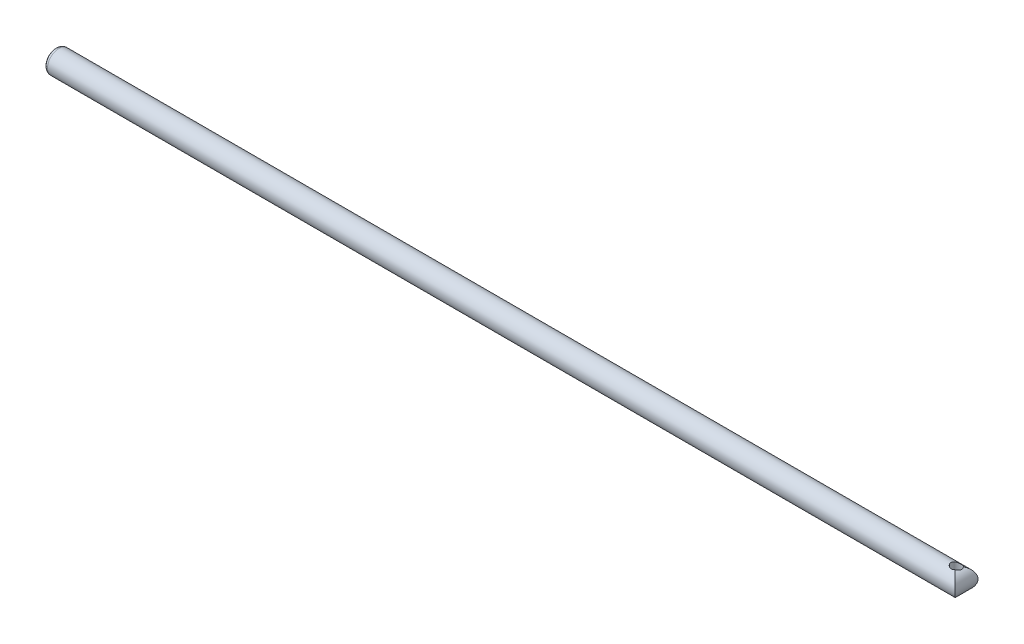
ISO-10303-21;
HEADER;
FILE_DESCRIPTION(('STEP AP214'),'2;1');
FILE_NAME('part.step','',(''),(''),'','','');
FILE_SCHEMA(('AUTOMOTIVE_DESIGN { 1 0 10303 214 1 1 1 1 }'));
ENDSEC;
DATA;
#1=APPLICATION_CONTEXT('core data for automotive mechanical design processes');
#2=APPLICATION_PROTOCOL_DEFINITION('international standard','automotive_design',2000,#1);
#3=PRODUCT_CONTEXT('',#1,'mechanical');
#4=PRODUCT('Part','Part','',(#3));
#5=PRODUCT_RELATED_PRODUCT_CATEGORY('part','',(#4));
#6=PRODUCT_DEFINITION_FORMATION('','',#4);
#7=PRODUCT_DEFINITION_CONTEXT('part definition',#1,'design');
#8=PRODUCT_DEFINITION('design','',#6,#7);
#9=PRODUCT_DEFINITION_SHAPE('','',#8);
#10=(LENGTH_UNIT() NAMED_UNIT(*) SI_UNIT(.MILLI.,.METRE.));
#11=(NAMED_UNIT(*) PLANE_ANGLE_UNIT() SI_UNIT($,.RADIAN.));
#12=(NAMED_UNIT(*) SI_UNIT($,.STERADIAN.) SOLID_ANGLE_UNIT());
#13=UNCERTAINTY_MEASURE_WITH_UNIT(LENGTH_MEASURE(1.E-05),#10,'distance_accuracy_value','');
#14=(GEOMETRIC_REPRESENTATION_CONTEXT(3) GLOBAL_UNCERTAINTY_ASSIGNED_CONTEXT((#13)) GLOBAL_UNIT_ASSIGNED_CONTEXT((#10,
#11,#12)) REPRESENTATION_CONTEXT('',''));
#15=CARTESIAN_POINT('',(0.,0.,0.));
#16=DIRECTION('',(0.,0.,1.));
#17=DIRECTION('',(1.,0.,0.));
#18=AXIS2_PLACEMENT_3D('',#15,#16,#17);
#19=CARTESIAN_POINT('',(180.,0.,0.));
#20=DIRECTION('',(-1.,0.,0.));
#21=DIRECTION('',(0.,0.,1.));
#22=AXIS2_PLACEMENT_3D('',#19,#20,#21);
#23=CYLINDRICAL_SURFACE('',#22,2.25);
#24=CARTESIAN_POINT('',(177.75,0.,0.));
#25=DIRECTION('',(-0.707106781186547,0.,-0.707106781186548));
#26=DIRECTION('',(-0.707106781186547,0.,0.707106781186548));
#27=AXIS2_PLACEMENT_3D('',#24,#25,#26);
#28=ELLIPSE('',#27,3.18198051533946,2.25);
#29=CARTESIAN_POINT('',(178.560849335627,2.09881475002268,-0.810849335623151));
#30=VERTEX_POINT('',#29);
#31=CARTESIAN_POINT('',(178.551395916308,-2.10244252842359,-0.801395916308426));
#32=VERTEX_POINT('',#31);
#33=EDGE_CURVE('E78',#30,#32,#28,.T.);
#34=ORIENTED_EDGE('',*,*,#33,.T.);
#35=CARTESIAN_POINT('',(177.75,-2.10419988484347,0.796770258371086));
#36=CARTESIAN_POINT('',(177.80435482041,-2.10420544863352,0.796764251965233));
#37=CARTESIAN_POINT('',(177.858775115431,-2.10590047120632,0.79232400252567));
#38=CARTESIAN_POINT('',(177.966076250969,-2.11244074949928,0.774710558955966));
#39=CARTESIAN_POINT('',(178.018953061624,-2.11729359388603,0.761516326336756));
#40=CARTESIAN_POINT('',(178.121457757545,-2.12941683443526,0.726922639785298));
#41=CARTESIAN_POINT('',(178.171095410676,-2.13667951808739,0.705549329349264));
#42=CARTESIAN_POINT('',(178.266095593463,-2.1526377090833,0.655243721952004));
#43=CARTESIAN_POINT('',(178.311458953109,-2.16133293734817,0.62631289665451));
#44=CARTESIAN_POINT('',(178.398679066051,-2.17940615270119,0.5602728930033));
#45=CARTESIAN_POINT('',(178.440317071859,-2.18879752130996,0.52287806469596));
#46=CARTESIAN_POINT('',(178.516874435757,-2.20664398271582,0.44153573861177));
#47=CARTESIAN_POINT('',(178.551792640876,-2.21509891473512,0.397587118637336));
#48=CARTESIAN_POINT('',(178.614307387898,-2.22993707700451,0.30359424453805));
#49=CARTESIAN_POINT('',(178.641805332655,-2.23629263849863,0.253479676424687));
#50=CARTESIAN_POINT('',(178.687917994432,-2.24566937803177,0.149033046182918));
#51=CARTESIAN_POINT('',(178.706537588277,-2.24869238782195,0.0947033185312892));
#52=CARTESIAN_POINT('',(178.733357137865,-2.2505670381474,-0.0129958039043502));
#53=CARTESIAN_POINT('',(178.742126699875,-2.24966342076814,-0.0662193172176533));
#54=CARTESIAN_POINT('',(178.751007302718,-2.2439646209085,-0.173169538585823));
#55=CARTESIAN_POINT('',(178.751120223224,-2.23917028347429,-0.226896134868976));
#56=CARTESIAN_POINT('',(178.743027754177,-2.22609728267993,-0.331126807939544));
#57=CARTESIAN_POINT('',(178.735146122667,-2.21796157536466,-0.381674901078165));
#58=CARTESIAN_POINT('',(178.71200449855,-2.19868305881426,-0.480444682467703));
#59=CARTESIAN_POINT('',(178.69674310081,-2.18753967708621,-0.528665925754645));
#60=CARTESIAN_POINT('',(178.658515167352,-2.16230627853514,-0.624089917147337));
#61=CARTESIAN_POINT('',(178.635201794949,-2.14809686751604,-0.671121439382455));
#62=CARTESIAN_POINT('',(178.581841541617,-2.11805978302221,-0.760628342102201));
#63=CARTESIAN_POINT('',(178.551791384822,-2.10223132430303,-0.803101491097982));
#64=CARTESIAN_POINT('',(178.482370462902,-2.06844434408804,-0.88671567367643));
#65=CARTESIAN_POINT('',(178.442374092798,-2.05042931730698,-0.927316025692772));
#66=CARTESIAN_POINT('',(178.355822913318,-2.01530648306342,-1.00136031276266));
#67=CARTESIAN_POINT('',(178.309263564024,-1.99819931498086,-1.03479925325127));
#68=CARTESIAN_POINT('',(178.20898449776,-1.96620792764164,-1.09439689265969));
#69=CARTESIAN_POINT('',(178.155097852635,-1.95140143823218,-1.12031956403278));
#70=CARTESIAN_POINT('',(178.042589905451,-1.92668985997372,-1.16231221665008));
#71=CARTESIAN_POINT('',(177.98397699461,-1.91677629759809,-1.1783992427968));
#72=CARTESIAN_POINT('',(177.871574465058,-1.90436923435145,-1.1983315186772));
#73=CARTESIAN_POINT('',(177.818097891373,-1.90110305995445,-1.20345573921654));
#74=CARTESIAN_POINT('',(177.710976193454,-1.90011732944658,-1.20501339054249));
#75=CARTESIAN_POINT('',(177.657331162561,-1.90239510884657,-1.20145099621645));
#76=CARTESIAN_POINT('',(177.557584120349,-1.9115940636931,-1.18674690894165));
#77=CARTESIAN_POINT('',(177.511298346114,-1.9179807266612,-1.17647583025386));
#78=CARTESIAN_POINT('',(177.421186267611,-1.93413425720229,-1.14972496725916));
#79=CARTESIAN_POINT('',(177.377360717361,-1.94390215456587,-1.13324329131374));
#80=CARTESIAN_POINT('',(177.289828884775,-1.96670997872858,-1.09321467455749));
#81=CARTESIAN_POINT('',(177.246370700207,-1.97993834825745,-1.06923566033495));
#82=CARTESIAN_POINT('',(177.163822109315,-2.00805706272226,-1.01544479531677));
#83=CARTESIAN_POINT('',(177.124734194382,-2.02294834607699,-0.98562964384323));
#84=CARTESIAN_POINT('',(177.046036390255,-2.05552997831111,-0.915959572745003));
#85=CARTESIAN_POINT('',(177.007196450243,-2.07330971176704,-0.875272848363502));
#86=CARTESIAN_POINT('',(176.936698356883,-2.10811038912013,-0.787774337569934));
#87=CARTESIAN_POINT('',(176.905043570689,-2.12513097427058,-0.740959695589022));
#88=CARTESIAN_POINT('',(176.848551663626,-2.15778038359356,-0.639864474400687));
#89=CARTESIAN_POINT('',(176.824086448953,-2.17331180619132,-0.585342388344454));
#90=CARTESIAN_POINT('',(176.785078289729,-2.20070630512967,-0.471996524571237));
#91=CARTESIAN_POINT('',(176.770527734991,-2.21257219118955,-0.413176084625355));
#92=CARTESIAN_POINT('',(176.753025621345,-2.23085522629106,-0.298145201967988));
#93=CARTESIAN_POINT('',(176.749208214572,-2.23764415220065,-0.242125978232259));
#94=CARTESIAN_POINT('',(176.751063985609,-2.24695156787491,-0.129897182815991));
#95=CARTESIAN_POINT('',(176.756732637996,-2.24947209277068,-0.0736877146589959));
#96=CARTESIAN_POINT('',(176.776650807049,-2.2503429351392,0.0326743864729406));
#97=CARTESIAN_POINT('',(176.790198797162,-2.24900228823857,0.0829581211188047));
#98=CARTESIAN_POINT('',(176.824861413704,-2.24326977640043,0.180654658915426));
#99=CARTESIAN_POINT('',(176.845976577965,-2.23887769456315,0.228067257721823));
#100=CARTESIAN_POINT('',(176.895517244158,-2.22767867869364,0.31954095051221));
#101=CARTESIAN_POINT('',(176.924050892435,-2.22083540079486,0.363538771180579));
#102=CARTESIAN_POINT('',(176.987488952068,-2.20567840833003,0.446384373246927));
#103=CARTESIAN_POINT('',(177.022395135727,-2.19736428471861,0.48523071673633));
#104=CARTESIAN_POINT('',(177.100277957522,-2.17971531499182,0.559365070820958));
#105=CARTESIAN_POINT('',(177.14363684714,-2.17034935623321,0.594244841822548));
#106=CARTESIAN_POINT('',(177.235676242681,-2.15236269767287,0.656419185666332));
#107=CARTESIAN_POINT('',(177.284360292644,-2.14374250111431,0.683708663635638));
#108=CARTESIAN_POINT('',(177.386971259744,-2.12828832279939,0.730417582625208));
#109=CARTESIAN_POINT('',(177.440990037547,-2.12149786631015,0.749650438626162));
#110=CARTESIAN_POINT('',(177.551703455639,-2.11104584562471,0.778607942503479));
#111=CARTESIAN_POINT('',(177.608390079329,-2.10737546935821,0.788359380126453));
#112=CARTESIAN_POINT('',(177.693580433513,-2.10464945502805,0.795581366687118));
#113=CARTESIAN_POINT('',(177.721781393317,-2.10419699637099,0.79677337663002));
#114=CARTESIAN_POINT('',(177.75,-2.10419988484347,0.796770258371086));
#115=B_SPLINE_CURVE_WITH_KNOTS('',3,(#35,#36,#37,#38,#39,#40,#41,#42,#43,#44,#45,#46,#47,#48,
#49,#50,#51,#52,#53,#54,#55,#56,#57,#58,#59,#60,#61,#62,#63,#64,#65,#66,#67,#68,#69,#70,#71,#72,
#73,#74,#75,#76,#77,#78,#79,#80,#81,#82,#83,#84,#85,#86,#87,#88,#89,#90,#91,#92,#93,#94,#95,#96,
#97,#98,#99,#100,#101,#102,#103,#104,#105,#106,#107,#108,#109,#110,#111,#112,#113,#114),
.UNSPECIFIED.,.T.,.F.,(4,2,2,2,2,2,2,2,2,2,2,2,2,2,2,2,2,2,2,2,2,2,2,2,2,2,2,2,2,2,2,2,2,2,2,2,
2,2,2,4),(0.,0.162975894499617,0.326344895438309,0.489196009605247,0.652015435623264,
0.821481604595542,0.9909768244386,1.16262422196473,1.33417722565863,1.49519612376585,
1.65618005867937,1.81089500264855,1.96563941647962,2.12811437209193,2.29066850573271,
2.46919031192936,2.6478362215749,2.83160035966881,3.01504513018025,3.17555688210092,
3.33599150542752,3.47889755762057,3.62184717170838,3.77535953428798,3.92895896927559,
4.10516590745245,4.28145525116701,4.46569603411258,4.64979523974863,4.81854661562319,
4.98721750984539,5.14277251302884,5.29833857438598,5.45631378350177,5.61433299512655,
5.78285726409091,5.95149438099883,6.12384590351471,6.29570901932292,6.38031885946408),.UNSPECIFIED.);
#116=CARTESIAN_POINT('',(178.348348086813,-2.1689812279056,0.598348086813265));
#117=VERTEX_POINT('',#116);
#118=EDGE_CURVE('E57',#32,#117,#115,.T.);
#119=ORIENTED_EDGE('',*,*,#118,.T.);
#120=CARTESIAN_POINT('',(177.75,0.,0.));
#121=DIRECTION('',(-0.707106781186547,0.,0.707106781186548));
#122=DIRECTION('',(-0.707106781186547,0.,-0.707106781186548));
#123=AXIS2_PLACEMENT_3D('',#120,#121,#122);
#124=ELLIPSE('',#123,3.18198051533946,2.25);
#125=CARTESIAN_POINT('',(178.335038550626,2.17260900630584,0.585038550626153));
#126=VERTEX_POINT('',#125);
#127=EDGE_CURVE('E77',#117,#126,#124,.T.);
#128=ORIENTED_EDGE('',*,*,#127,.T.);
#129=CARTESIAN_POINT('',(177.75,2.11255162111916,0.774354988430263));
#130=CARTESIAN_POINT('',(177.69564517959,2.11255712073927,0.774348923213897));
#131=CARTESIAN_POINT('',(177.64122488457,2.11420484218896,0.769890904524832));
#132=CARTESIAN_POINT('',(177.533923749031,2.12055749822516,0.752208925115895));
#133=CARTESIAN_POINT('',(177.481046938376,2.12526979738429,0.738963846419011));
#134=CARTESIAN_POINT('',(177.378542242455,2.13702457922476,0.704243229855964));
#135=CARTESIAN_POINT('',(177.328904589325,2.14405962776922,0.682793916002069));
#136=CARTESIAN_POINT('',(177.233904406537,2.15948210621981,0.632321496267027));
#137=CARTESIAN_POINT('',(177.188541046891,2.16786927270838,0.603299864933397));
#138=CARTESIAN_POINT('',(177.101320933949,2.18523937993666,0.537071452825552));
#139=CARTESIAN_POINT('',(177.059682928142,2.19423266462916,0.499578895978618));
#140=CARTESIAN_POINT('',(176.983125564243,2.21121334815018,0.418051436894839));
#141=CARTESIAN_POINT('',(176.948207359125,2.21920057427964,0.374015414233096));
#142=CARTESIAN_POINT('',(176.885692612103,2.2330386377331,0.279870103989643));
#143=CARTESIAN_POINT('',(176.858194667345,2.23886106034028,0.229690800546113));
#144=CARTESIAN_POINT('',(176.812082005569,2.24712687336922,0.125150386599626));
#145=CARTESIAN_POINT('',(176.793462411724,2.24957212025697,0.0707915909677428));
#146=CARTESIAN_POINT('',(176.766642862135,2.25030169003857,-0.0369213748960842));
#147=CARTESIAN_POINT('',(176.757873300125,2.24883229208682,-0.0901322738119914));
#148=CARTESIAN_POINT('',(176.748992697282,2.24199680142568,-0.197015865807969));
#149=CARTESIAN_POINT('',(176.748879776776,2.23663155490298,-0.250688456106528));
#150=CARTESIAN_POINT('',(176.756972245823,2.22245119220165,-0.354774256637488));
#151=CARTESIAN_POINT('',(176.764853877333,2.21377855604084,-0.405233000532797));
#152=CARTESIAN_POINT('',(176.787995501451,2.19345108429561,-0.503792245703242));
#153=CARTESIAN_POINT('',(176.80325689919,2.18179568098113,-0.551892295953245));
#154=CARTESIAN_POINT('',(176.841484832649,2.15554923364175,-0.647042632462428));
#155=CARTESIAN_POINT('',(176.864798205052,2.14084062251047,-0.693920433219825));
#156=CARTESIAN_POINT('',(176.918158458383,2.10985366665573,-0.783102946338866));
#157=CARTESIAN_POINT('',(176.948208615179,2.09357456045568,-0.825405418989655));
#158=CARTESIAN_POINT('',(177.017629537099,2.05890056768658,-0.908655678963783));
#159=CARTESIAN_POINT('',(177.057625907203,2.04045492713797,-0.9490622145555));
#160=CARTESIAN_POINT('',(177.144177086683,2.00454689563474,-1.02272891806905));
#161=CARTESIAN_POINT('',(177.190736435977,1.98708519712233,-1.0559840985056));
#162=CARTESIAN_POINT('',(177.291015502241,1.95446202125119,-1.11523826192915));
#163=CARTESIAN_POINT('',(177.344902147365,1.93938077861104,-1.14100205707231));
#164=CARTESIAN_POINT('',(177.457410094549,1.91422416315451,-1.1827296219741));
#165=CARTESIAN_POINT('',(177.516023005391,1.904140136082,-1.19871034558793));
#166=CARTESIAN_POINT('',(177.628425534942,1.89152186930337,-1.21850959263629));
#167=CARTESIAN_POINT('',(177.681902108628,1.88820140269921,-1.2235988001245));
#168=CARTESIAN_POINT('',(177.789023806546,1.88719916814194,-1.22514588389068));
#169=CARTESIAN_POINT('',(177.84266883744,1.88951469146604,-1.22160790649326));
#170=CARTESIAN_POINT('',(177.942415879651,1.89886944904706,-1.20700244643703));
#171=CARTESIAN_POINT('',(177.988701653886,1.90536494532835,-1.19679984631066));
#172=CARTESIAN_POINT('',(178.078813732389,1.92180195767371,-1.17022222705947));
#173=CARTESIAN_POINT('',(178.122639282639,1.93174452358063,-1.15384532735098));
#174=CARTESIAN_POINT('',(178.210171115225,1.95497661240323,-1.11406144806056));
#175=CARTESIAN_POINT('',(178.253629299793,1.96845916087282,-1.09022442286357));
#176=CARTESIAN_POINT('',(178.336177890685,1.99714814954767,-1.03673553437846));
#177=CARTESIAN_POINT('',(178.375265805618,2.01235556320894,-1.00708038057553));
#178=CARTESIAN_POINT('',(178.453963609745,2.04567603299936,-0.937760629718961));
#179=CARTESIAN_POINT('',(178.492803549758,2.06388731176486,-0.897265225184798));
#180=CARTESIAN_POINT('',(178.563301643117,2.09961623958806,-0.810141633363005));
#181=CARTESIAN_POINT('',(178.594956429311,2.11713356027755,-0.763510586853988));
#182=CARTESIAN_POINT('',(178.651448336374,2.15085589145914,-0.662768182396201));
#183=CARTESIAN_POINT('',(178.675913551047,2.16696607339683,-0.608414295747982));
#184=CARTESIAN_POINT('',(178.714921710272,2.19556403061671,-0.495366074844562));
#185=CARTESIAN_POINT('',(178.729472265009,2.20805457997479,-0.436675108042618));
#186=CARTESIAN_POINT('',(178.746974378656,2.22755950210603,-0.321845097374193));
#187=CARTESIAN_POINT('',(178.750791785429,2.23494359784314,-0.265901214124057));
#188=CARTESIAN_POINT('',(178.748936014391,2.24544361814191,-0.153777710429044));
#189=CARTESIAN_POINT('',(178.743267362004,2.24856157661908,-0.0975982151378151));
#190=CARTESIAN_POINT('',(178.723349192951,2.25056313018826,0.00874861700560667));
#191=CARTESIAN_POINT('',(178.709801202838,2.24975713721489,0.059043762689607));
#192=CARTESIAN_POINT('',(178.675138586296,2.24506358411996,0.156795723021701));
#193=CARTESIAN_POINT('',(178.654023422036,2.24117580493847,0.204252335642894));
#194=CARTESIAN_POINT('',(178.604482755843,2.23094990021853,0.295839918326433));
#195=CARTESIAN_POINT('',(178.575949107566,2.22457476019402,0.339908005029092));
#196=CARTESIAN_POINT('',(178.512511047932,2.21029937530277,0.422910062765756));
#197=CARTESIAN_POINT('',(178.477604864274,2.20239870612703,0.461842600321104));
#198=CARTESIAN_POINT('',(178.399722042478,2.18553887348526,0.536160395170349));
#199=CARTESIAN_POINT('',(178.35636315286,2.17654425904349,0.57113776670732));
#200=CARTESIAN_POINT('',(178.26432375732,2.15921960698127,0.633499817262884));
#201=CARTESIAN_POINT('',(178.215639707356,2.15089001841076,0.660879396346419));
#202=CARTESIAN_POINT('',(178.113028740256,2.13593328692076,0.707749972657139));
#203=CARTESIAN_POINT('',(178.059009962454,2.12934768317958,0.727053932682214));
#204=CARTESIAN_POINT('',(177.948296544361,2.11920410717856,0.756120917959775));
#205=CARTESIAN_POINT('',(177.891609920671,2.11563760815451,0.765910825128075));
#206=CARTESIAN_POINT('',(177.806419566488,2.11298852651108,0.773161384448376));
#207=CARTESIAN_POINT('',(177.778218606684,2.11254876596085,0.774358137221002));
#208=CARTESIAN_POINT('',(177.75,2.11255162111916,0.774354988430263));
#209=B_SPLINE_CURVE_WITH_KNOTS('',3,(#129,#130,#131,#132,#133,#134,#135,#136,#137,#138,#139,
#140,#141,#142,#143,#144,#145,#146,#147,#148,#149,#150,#151,#152,#153,#154,#155,#156,#157,#158,
#159,#160,#161,#162,#163,#164,#165,#166,#167,#168,#169,#170,#171,#172,#173,#174,#175,#176,#177,
#178,#179,#180,#181,#182,#183,#184,#185,#186,#187,#188,#189,#190,#191,#192,#193,#194,#195,#196,
#197,#198,#199,#200,#201,#202,#203,#204,#205,#206,#207,#208),.UNSPECIFIED.,.T.,.F.,(4,2,2,2,2,2,
2,2,2,2,2,2,2,2,2,2,2,2,2,2,2,2,2,2,2,2,2,2,2,2,2,2,2,2,2,2,2,2,2,4),(0.,0.162975894499589,
0.326344895438308,0.489196009605244,0.652015435623259,0.821481604595536,0.9909768244386,
1.16262422196475,1.33417722565863,1.49519612376586,1.65618005867937,1.81089500264855,
1.96563941647962,2.12811437209192,2.29066850573272,2.46919031192936,2.6478362215749,
2.83160035966885,3.01504513018023,3.17555688210093,3.33599150542753,3.47889755762061,
3.62184717170839,3.77535953428799,3.92895896927559,4.10516590745246,4.28145525116701,
4.46569603411257,4.64979523974862,4.81854661562319,4.9872175098454,5.14277251302884,
5.29833857438599,5.45631378350178,5.61433299512655,5.78285726409091,5.95149438099883,
6.12384590351465,6.29570901932292,6.38031885946408),.UNSPECIFIED.);
#210=EDGE_CURVE('E64',#126,#30,#209,.T.);
#211=ORIENTED_EDGE('',*,*,#210,.T.);
#212=EDGE_LOOP('',(#34,#119,#128,#211));
#213=FACE_BOUND('',#212,.T.);
#214=CARTESIAN_POINT('',(0.749999999999973,0.,0.));
#215=DIRECTION('',(1.,0.,0.));
#216=DIRECTION('',(0.,0.,-1.));
#217=AXIS2_PLACEMENT_3D('',#214,#215,#216);
#218=CIRCLE('',#217,2.25);
#219=CARTESIAN_POINT('',(0.749999999999973,0.,-2.25));
#220=VERTEX_POINT('',#219);
#221=EDGE_CURVE('E81',#220,#220,#218,.T.);
#222=ORIENTED_EDGE('',*,*,#221,.T.);
#223=EDGE_LOOP('',(#222));
#224=FACE_BOUND('',#223,.T.);
#225=ADVANCED_FACE('F38',(#213,#224),#23,.T.);
#226=CARTESIAN_POINT('',(0.,0.,0.));
#227=DIRECTION('',(1.,0.,0.));
#228=DIRECTION('',(0.,0.,-1.));
#229=AXIS2_PLACEMENT_3D('',#226,#227,#228);
#230=PLANE('',#229);
#231=CARTESIAN_POINT('',(0.,0.,0.));
#232=DIRECTION('',(1.,0.,0.));
#233=DIRECTION('',(0.,0.,-1.));
#234=AXIS2_PLACEMENT_3D('',#231,#232,#233);
#235=CIRCLE('',#234,1.5);
#236=CARTESIAN_POINT('',(0.,0.,-1.5));
#237=VERTEX_POINT('',#236);
#238=EDGE_CURVE('E73',#237,#237,#235,.F.);
#239=ORIENTED_EDGE('',*,*,#238,.T.);
#240=EDGE_LOOP('',(#239));
#241=FACE_BOUND('',#240,.T.);
#242=ADVANCED_FACE('F105',(#241),#230,.F.);
#243=CARTESIAN_POINT('',(0.750000000000001,0.,0.));
#244=DIRECTION('',(1.,0.,0.));
#245=DIRECTION('',(0.,0.,-1.));
#246=AXIS2_PLACEMENT_3D('',#243,#244,#245);
#247=TOROIDAL_SURFACE('',#246,1.5,0.75);
#248=ORIENTED_EDGE('',*,*,#238,.F.);
#249=EDGE_LOOP('',(#248));
#250=FACE_BOUND('',#249,.T.);
#251=ORIENTED_EDGE('',*,*,#221,.F.);
#252=EDGE_LOOP('',(#251));
#253=FACE_BOUND('',#252,.T.);
#254=ADVANCED_FACE('F40',(#250,#253),#247,.T.);
#255=CARTESIAN_POINT('',(177.75,0.,-2.25));
#256=DIRECTION('',(0.,0.,1.));
#257=DIRECTION('',(1.,0.,0.));
#258=AXIS2_PLACEMENT_3D('',#255,#256,#257);
#259=CYLINDRICAL_SURFACE('',#258,2.25);
#260=ORIENTED_EDGE('',*,*,#33,.F.);
#261=CARTESIAN_POINT('',(177.70759101064,2.24960029285682,-1.22550210900627));
#262=CARTESIAN_POINT('',(177.73406618257,2.25010181693245,-1.22662970193488));
#263=CARTESIAN_POINT('',(177.76058207746,2.25013117210126,-1.22669926851574));
#264=CARTESIAN_POINT('',(177.81351280435,2.24925878092414,-1.2247323097671));
#265=CARTESIAN_POINT('',(177.839927662985,2.24835729979618,-1.22269638434337));
#266=CARTESIAN_POINT('',(177.918523052965,2.24428923638491,-1.21347431098818));
#267=CARTESIAN_POINT('',(177.970306175889,2.23976345259645,-1.2031841703513));
#268=CARTESIAN_POINT('',(178.07119004477,2.22753795133979,-1.17474923443598));
#269=CARTESIAN_POINT('',(178.120292465623,2.21984024199093,-1.15660940836337));
#270=CARTESIAN_POINT('',(178.214743054335,2.20200503952816,-1.11311790949662));
#271=CARTESIAN_POINT('',(178.260088349262,2.19186570211791,-1.08776078242971));
#272=CARTESIAN_POINT('',(178.348049673653,2.16956003358553,-1.02924888248191));
#273=CARTESIAN_POINT('',(178.390443932702,2.15732187224412,-0.995788857043284));
#274=CARTESIAN_POINT('',(178.469263823456,2.13233951580964,-0.922588525264216));
#275=CARTESIAN_POINT('',(178.505686241035,2.11959505277206,-0.882844859438251));
#276=CARTESIAN_POINT('',(178.574106260305,2.09398559219687,-0.794916156392346));
#277=CARTESIAN_POINT('',(178.605618855999,2.08117404667667,-0.746335939918807));
#278=CARTESIAN_POINT('',(178.65999253789,2.05798243773446,-0.64401540811392));
#279=CARTESIAN_POINT('',(178.68285675766,2.04760149415073,-0.590276970630861));
#280=CARTESIAN_POINT('',(178.718392328565,2.03103211160309,-0.480961452739672));
#281=CARTESIAN_POINT('',(178.731384989163,2.02471265039288,-0.425509761339818));
#282=CARTESIAN_POINT('',(178.747761938017,2.01669520229134,-0.312894175065743));
#283=CARTESIAN_POINT('',(178.751154219545,2.01499337081196,-0.255731744654481));
#284=CARTESIAN_POINT('',(178.74829398396,2.01640935293161,-0.147265990970217));
#285=CARTESIAN_POINT('',(178.742941578099,2.0190774301012,-0.0959301381548461));
#286=CARTESIAN_POINT('',(178.724494901461,2.02804422774588,0.00499829506323588));
#287=CARTESIAN_POINT('',(178.711399530743,2.03434346404865,0.0545906267262557));
#288=CARTESIAN_POINT('',(178.677977896352,2.0498030730952,0.150786341546638));
#289=CARTESIAN_POINT('',(178.657650446119,2.05896391531027,0.197389232747079));
#290=CARTESIAN_POINT('',(178.610386516369,2.07915707111025,0.286671972674799));
#291=CARTESIAN_POINT('',(178.583447265311,2.09019016890907,0.32935016590332));
#292=CARTESIAN_POINT('',(178.520756547335,2.11415744167681,0.413842500897442));
#293=CARTESIAN_POINT('',(178.484413627004,2.12717277562047,0.455195603060604));
#294=CARTESIAN_POINT('',(178.405362575322,2.15284148978079,0.5314503051389));
#295=CARTESIAN_POINT('',(178.3626521061,2.16549473501273,0.566349524896938));
#296=CARTESIAN_POINT('',(178.269593318097,2.18973486627199,0.630307717508507));
#297=CARTESIAN_POINT('',(178.21897940512,2.20124308022534,0.659012672760652));
#298=CARTESIAN_POINT('',(178.113066285532,2.22116576399824,0.707354239397949));
#299=CARTESIAN_POINT('',(178.05777236395,2.22958366775772,0.727000922550588));
#300=CARTESIAN_POINT('',(177.953434734828,2.24129479892328,0.753988843968727));
#301=CARTESIAN_POINT('',(177.904844817317,2.245200393198,0.762815612061512));
#302=CARTESIAN_POINT('',(177.8312459787,2.24866801660714,0.770632942113949));
#303=CARTESIAN_POINT('',(177.806554276756,2.24942472130884,0.772333282758124));
#304=CARTESIAN_POINT('',(177.757093026326,2.25012514750299,0.773904784079775));
#305=CARTESIAN_POINT('',(177.732323454534,2.25006859657287,0.773775331817508));
#306=CARTESIAN_POINT('',(177.70759101064,2.24960029285682,0.772726790977271));
#307=B_SPLINE_CURVE_WITH_KNOTS('',3,(#261,#262,#263,#264,#265,#266,#267,#268,#269,#270,#271,
#272,#273,#274,#275,#276,#277,#278,#279,#280,#281,#282,#283,#284,#285,#286,#287,#288,#289,#290,
#291,#292,#293,#294,#295,#296,#297,#298,#299,#300,#301,#302,#303,#304,#305,#306),.UNSPECIFIED.,
.F.,.F.,(4,2,2,2,2,2,2,2,2,2,2,2,2,2,2,2,2,2,2,2,2,2,4),(0.,0.0794605433446613,0.15889845268837,
0.317028423617289,0.475058437230851,0.63320819614137,0.798639111476293,0.964158773760093,
1.1412091102617,1.31819523436704,1.48913958363216,1.65994156276426,1.81424257000988,
1.96856550203178,2.12291376537971,2.2773268394227,2.44630183107034,2.61533901604837,
2.79236600555769,2.96919568368375,3.11715007781427,3.19136324069982,3.26560126392586),.UNSPECIFIED.);
#308=EDGE_CURVE('E11',#30,#126,#307,.T.);
#309=ORIENTED_EDGE('',*,*,#308,.T.);
#310=ORIENTED_EDGE('',*,*,#127,.F.);
#311=CARTESIAN_POINT('',(177.70759101064,-2.24960029285682,0.796643494511751));
#312=CARTESIAN_POINT('',(177.73406618257,-2.25010181693245,0.797771087440359));
#313=CARTESIAN_POINT('',(177.76058207746,-2.25013117210126,0.797840654021217));
#314=CARTESIAN_POINT('',(177.81351280435,-2.24925878092414,0.795873695272581));
#315=CARTESIAN_POINT('',(177.839927662985,-2.24835729979618,0.79383776984885));
#316=CARTESIAN_POINT('',(177.918523052965,-2.24428923638491,0.784615696493658));
#317=CARTESIAN_POINT('',(177.970306175889,-2.23976345259645,0.774325555856786));
#318=CARTESIAN_POINT('',(178.07119004477,-2.22753795133979,0.745890619941464));
#319=CARTESIAN_POINT('',(178.120292465623,-2.21984024199093,0.727750793868857));
#320=CARTESIAN_POINT('',(178.214743054335,-2.20200503952816,0.684259295002112));
#321=CARTESIAN_POINT('',(178.260088349262,-2.19186570211791,0.658902167935197));
#322=CARTESIAN_POINT('',(178.348049673653,-2.16956003358553,0.600390267987399));
#323=CARTESIAN_POINT('',(178.390443932702,-2.15732187224412,0.566930242548772));
#324=CARTESIAN_POINT('',(178.469263823456,-2.13233951580964,0.493729910769706));
#325=CARTESIAN_POINT('',(178.505686241035,-2.11959505277206,0.45398624494374));
#326=CARTESIAN_POINT('',(178.574106260305,-2.09398559219687,0.366057541897835));
#327=CARTESIAN_POINT('',(178.605618855999,-2.08117404667667,0.317477325424295));
#328=CARTESIAN_POINT('',(178.65999253789,-2.05798243773446,0.215156793619399));
#329=CARTESIAN_POINT('',(178.68285675766,-2.04760149415072,0.161418356136332));
#330=CARTESIAN_POINT('',(178.718392328565,-2.03103211160308,0.052102838245137));
#331=CARTESIAN_POINT('',(178.731384989163,-2.02471265039288,-0.00334885315471191));
#332=CARTESIAN_POINT('',(178.747761938017,-2.01669520229133,-0.11596443942878));
#333=CARTESIAN_POINT('',(178.751154219545,-2.01499337081195,-0.173126869840039));
#334=CARTESIAN_POINT('',(178.74829398396,-2.01640935293161,-0.281592623524297));
#335=CARTESIAN_POINT('',(178.742941578099,-2.0190774301012,-0.332928476339665));
#336=CARTESIAN_POINT('',(178.724494901461,-2.02804422774587,-0.433856909557745));
#337=CARTESIAN_POINT('',(178.711399530743,-2.03434346404864,-0.483449241220767));
#338=CARTESIAN_POINT('',(178.677977896352,-2.04980307309519,-0.579644956041149));
#339=CARTESIAN_POINT('',(178.657650446119,-2.05896391531026,-0.626247847241588));
#340=CARTESIAN_POINT('',(178.610386516369,-2.07915707111024,-0.71553058716931));
#341=CARTESIAN_POINT('',(178.583447265311,-2.09019016890906,-0.758208780397834));
#342=CARTESIAN_POINT('',(178.520756547335,-2.1141574416768,-0.842701115391951));
#343=CARTESIAN_POINT('',(178.484413627004,-2.12717277562046,-0.884054217555104));
#344=CARTESIAN_POINT('',(178.405362575322,-2.15284148978078,-0.9603089196334));
#345=CARTESIAN_POINT('',(178.3626521061,-2.16549473501272,-0.995208139391446));
#346=CARTESIAN_POINT('',(178.269593318097,-2.18973486627199,-1.05916633200303));
#347=CARTESIAN_POINT('',(178.21897940512,-2.20124308022534,-1.08787128725519));
#348=CARTESIAN_POINT('',(178.113066285532,-2.22116576399824,-1.13621285389248));
#349=CARTESIAN_POINT('',(178.05777236395,-2.22958366775772,-1.15585953704511));
#350=CARTESIAN_POINT('',(177.953434734828,-2.24129479892328,-1.18284745846325));
#351=CARTESIAN_POINT('',(177.904844817317,-2.245200393198,-1.19167422655604));
#352=CARTESIAN_POINT('',(177.8312459787,-2.24866801660714,-1.19949155660847));
#353=CARTESIAN_POINT('',(177.806554276756,-2.24942472130884,-1.20119189725265));
#354=CARTESIAN_POINT('',(177.757093026326,-2.25012514750299,-1.2027633985743));
#355=CARTESIAN_POINT('',(177.732323454534,-2.25006859657287,-1.20263394631203));
#356=CARTESIAN_POINT('',(177.70759101064,-2.24960029285682,-1.20158540547179));
#357=B_SPLINE_CURVE_WITH_KNOTS('',3,(#311,#312,#313,#314,#315,#316,#317,#318,#319,#320,#321,
#322,#323,#324,#325,#326,#327,#328,#329,#330,#331,#332,#333,#334,#335,#336,#337,#338,#339,#340,
#341,#342,#343,#344,#345,#346,#347,#348,#349,#350,#351,#352,#353,#354,#355,#356),.UNSPECIFIED.,
.F.,.F.,(4,2,2,2,2,2,2,2,2,2,2,2,2,2,2,2,2,2,2,2,2,2,4),(0.,0.0794605433446613,0.15889845268837,
0.317028423617289,0.47505843723082,0.633208196141367,0.798639111476288,0.964158773760086,
1.14120911026172,1.31819523436708,1.48913958363218,1.65994156276427,1.81424257000989,
1.96856550203178,2.12291376537971,2.2773268394227,2.44630183107033,2.61533901604837,
2.79236600555776,2.96919568368375,3.1171500778143,3.19136324069986,3.26560126392589),.UNSPECIFIED.);
#358=EDGE_CURVE('E51',#117,#32,#357,.T.);
#359=ORIENTED_EDGE('',*,*,#358,.T.);
#360=EDGE_LOOP('',(#260,#309,#310,#359));
#361=FACE_BOUND('',#360,.T.);
#362=ADVANCED_FACE('F80',(#361),#259,.T.);
#363=CARTESIAN_POINT('',(177.75,-3.37179699095413,-0.196505618922014));
#364=DIRECTION('',(0.,0.999985871608211,-0.00531569223783085));
#365=DIRECTION('',(0.,0.00531569223783085,0.999985871608211));
#366=AXIS2_PLACEMENT_3D('',#363,#364,#365);
#367=CYLINDRICAL_SURFACE('',#366,1.);
#368=ORIENTED_EDGE('',*,*,#358,.F.);
#369=ORIENTED_EDGE('',*,*,#118,.F.);
#370=EDGE_LOOP('',(#368,#369));
#371=FACE_BOUND('',#370,.T.);
#372=ORIENTED_EDGE('',*,*,#308,.F.);
#373=ORIENTED_EDGE('',*,*,#210,.F.);
#374=EDGE_LOOP('',(#372,#373));
#375=FACE_BOUND('',#374,.T.);
#376=ADVANCED_FACE('F68',(#371,#375),#367,.F.);
#377=CLOSED_SHELL('',(#225,#242,#254,#362,#376));
#378=MANIFOLD_SOLID_BREP('B2',#377);
#379=ADVANCED_BREP_SHAPE_REPRESENTATION('',(#18,#378),#14);
#380=SHAPE_DEFINITION_REPRESENTATION(#9,#379);
ENDSEC;
END-ISO-10303-21;
